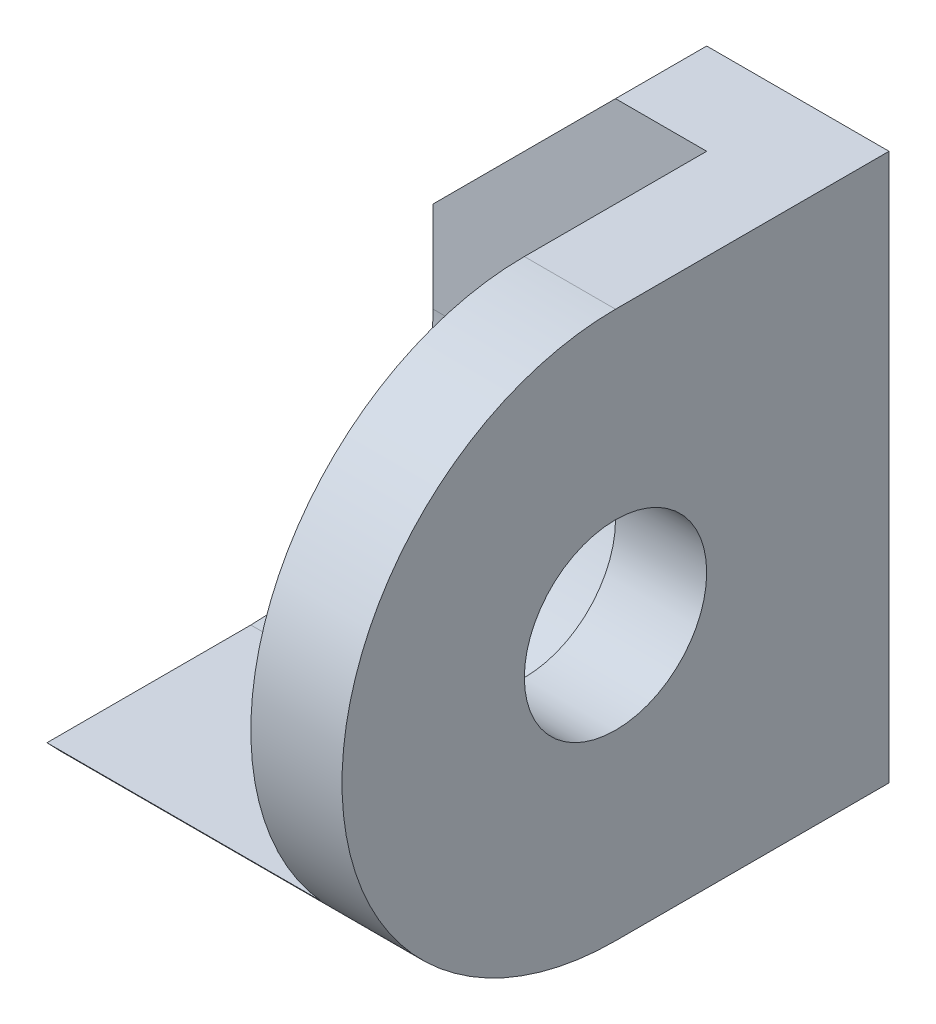
ISO-10303-21;
HEADER;
FILE_DESCRIPTION(('STEP AP214'),'2;1');
FILE_NAME('part.step','',(''),(''),'','','');
FILE_SCHEMA(('AUTOMOTIVE_DESIGN { 1 0 10303 214 1 1 1 1 }'));
ENDSEC;
DATA;
#1=APPLICATION_CONTEXT('core data for automotive mechanical design processes');
#2=APPLICATION_PROTOCOL_DEFINITION('international standard','automotive_design',2000,#1);
#3=PRODUCT_CONTEXT('',#1,'mechanical');
#4=PRODUCT('Part','Part','',(#3));
#5=PRODUCT_RELATED_PRODUCT_CATEGORY('part','',(#4));
#6=PRODUCT_DEFINITION_FORMATION('','',#4);
#7=PRODUCT_DEFINITION_CONTEXT('part definition',#1,'design');
#8=PRODUCT_DEFINITION('design','',#6,#7);
#9=PRODUCT_DEFINITION_SHAPE('','',#8);
#10=(LENGTH_UNIT() NAMED_UNIT(*) SI_UNIT(.MILLI.,.METRE.));
#11=(NAMED_UNIT(*) PLANE_ANGLE_UNIT() SI_UNIT($,.RADIAN.));
#12=(NAMED_UNIT(*) SI_UNIT($,.STERADIAN.) SOLID_ANGLE_UNIT());
#13=UNCERTAINTY_MEASURE_WITH_UNIT(LENGTH_MEASURE(1.E-05),#10,'distance_accuracy_value','');
#14=(GEOMETRIC_REPRESENTATION_CONTEXT(3) GLOBAL_UNCERTAINTY_ASSIGNED_CONTEXT((#13)) GLOBAL_UNIT_ASSIGNED_CONTEXT((#10,
#11,#12)) REPRESENTATION_CONTEXT('',''));
#15=CARTESIAN_POINT('',(0.,0.,0.));
#16=DIRECTION('',(0.,0.,1.));
#17=DIRECTION('',(1.,0.,0.));
#18=AXIS2_PLACEMENT_3D('',#15,#16,#17);
#19=CARTESIAN_POINT('',(-3.,0.,0.));
#20=DIRECTION('',(0.,-1.,0.));
#21=DIRECTION('',(0.,0.,-1.));
#22=AXIS2_PLACEMENT_3D('',#19,#20,#21);
#23=PLANE('',#22);
#24=DIRECTION('',(1.,0.,0.));
#25=VECTOR('',#24,1.);
#26=CARTESIAN_POINT('',(-3.,0.,0.));
#27=LINE('',#26,#25);
#28=CARTESIAN_POINT('',(-3.,0.,0.));
#29=VERTEX_POINT('',#28);
#30=CARTESIAN_POINT('',(1.,0.,0.));
#31=VERTEX_POINT('',#30);
#32=EDGE_CURVE('E171',#29,#31,#27,.T.);
#33=ORIENTED_EDGE('',*,*,#32,.T.);
#34=DIRECTION('',(0.,0.,-1.));
#35=VECTOR('',#34,1.);
#36=CARTESIAN_POINT('',(1.,0.,0.));
#37=LINE('',#36,#35);
#38=CARTESIAN_POINT('',(1.,0.,3.));
#39=VERTEX_POINT('',#38);
#40=EDGE_CURVE('E152',#39,#31,#37,.T.);
#41=ORIENTED_EDGE('',*,*,#40,.F.);
#42=DIRECTION('',(1.,0.,0.));
#43=VECTOR('',#42,1.);
#44=CARTESIAN_POINT('',(-3.,0.,3.));
#45=LINE('',#44,#43);
#46=CARTESIAN_POINT('',(-3.,0.,3.));
#47=VERTEX_POINT('',#46);
#48=EDGE_CURVE('E172',#47,#39,#45,.T.);
#49=ORIENTED_EDGE('',*,*,#48,.F.);
#50=DIRECTION('',(0.,0.,-1.));
#51=VECTOR('',#50,1.);
#52=CARTESIAN_POINT('',(-3.,0.,0.));
#53=LINE('',#52,#51);
#54=EDGE_CURVE('E164',#47,#29,#53,.T.);
#55=ORIENTED_EDGE('',*,*,#54,.T.);
#56=EDGE_LOOP('',(#33,#41,#49,#55));
#57=FACE_BOUND('',#56,.T.);
#58=ADVANCED_FACE('F37',(#57),#23,.T.);
#59=CARTESIAN_POINT('',(-3.,3.,3.));
#60=DIRECTION('',(1.,0.,0.));
#61=DIRECTION('',(0.,0.,-1.));
#62=AXIS2_PLACEMENT_3D('',#59,#60,#61);
#63=CYLINDRICAL_SURFACE('',#62,3.);
#64=DIRECTION('',(1.,0.,0.));
#65=VECTOR('',#64,1.);
#66=CARTESIAN_POINT('',(-3.,1.,5.23606797749979));
#67=LINE('',#66,#65);
#68=CARTESIAN_POINT('',(-3.,1.,5.23606797749979));
#69=VERTEX_POINT('',#68);
#70=CARTESIAN_POINT('',(0.,1.,5.23606797749979));
#71=VERTEX_POINT('',#70);
#72=EDGE_CURVE('E124',#69,#71,#67,.T.);
#73=ORIENTED_EDGE('',*,*,#72,.F.);
#74=CARTESIAN_POINT('',(-3.,3.,3.));
#75=DIRECTION('',(1.,0.,0.));
#76=DIRECTION('',(0.,0.,-1.));
#77=AXIS2_PLACEMENT_3D('',#74,#75,#76);
#78=CIRCLE('',#77,3.);
#79=EDGE_CURVE('E169',#69,#47,#78,.T.);
#80=ORIENTED_EDGE('',*,*,#79,.T.);
#81=ORIENTED_EDGE('',*,*,#48,.T.);
#82=CARTESIAN_POINT('',(1.,3.,3.));
#83=DIRECTION('',(1.,0.,0.));
#84=DIRECTION('',(0.,0.,-1.));
#85=AXIS2_PLACEMENT_3D('',#82,#83,#84);
#86=CIRCLE('',#85,3.);
#87=CARTESIAN_POINT('',(1.,6.,3.));
#88=VERTEX_POINT('',#87);
#89=EDGE_CURVE('E161',#88,#39,#86,.T.);
#90=ORIENTED_EDGE('',*,*,#89,.F.);
#91=DIRECTION('',(1.,0.,0.));
#92=VECTOR('',#91,1.);
#93=CARTESIAN_POINT('',(-3.,6.,3.));
#94=LINE('',#93,#92);
#95=CARTESIAN_POINT('',(0.,6.,3.));
#96=VERTEX_POINT('',#95);
#97=EDGE_CURVE('E175',#96,#88,#94,.T.);
#98=ORIENTED_EDGE('',*,*,#97,.F.);
#99=CARTESIAN_POINT('',(0.,3.,3.));
#100=DIRECTION('',(1.,0.,0.));
#101=DIRECTION('',(0.,0.,-1.));
#102=AXIS2_PLACEMENT_3D('',#99,#100,#101);
#103=CIRCLE('',#102,3.);
#104=EDGE_CURVE('E144',#71,#96,#103,.F.);
#105=ORIENTED_EDGE('',*,*,#104,.F.);
#106=EDGE_LOOP('',(#73,#80,#81,#90,#98,#105));
#107=FACE_BOUND('',#106,.T.);
#108=ADVANCED_FACE('F198',(#107),#63,.T.);
#109=CARTESIAN_POINT('',(-3.,6.,0.));
#110=DIRECTION('',(0.,1.,0.));
#111=DIRECTION('',(0.,0.,1.));
#112=AXIS2_PLACEMENT_3D('',#109,#110,#111);
#113=PLANE('',#112);
#114=DIRECTION('',(1.,0.,0.));
#115=VECTOR('',#114,1.);
#116=CARTESIAN_POINT('',(-3.,6.,0.));
#117=LINE('',#116,#115);
#118=CARTESIAN_POINT('',(-1.,6.,0.));
#119=VERTEX_POINT('',#118);
#120=CARTESIAN_POINT('',(1.,6.,0.));
#121=VERTEX_POINT('',#120);
#122=EDGE_CURVE('E177',#119,#121,#117,.T.);
#123=ORIENTED_EDGE('',*,*,#122,.F.);
#124=DIRECTION('',(0.,0.,1.));
#125=VECTOR('',#124,1.);
#126=CARTESIAN_POINT('',(-1.,6.,1.));
#127=LINE('',#126,#125);
#128=CARTESIAN_POINT('',(-1.,6.,1.));
#129=VERTEX_POINT('',#128);
#130=EDGE_CURVE('E174',#119,#129,#127,.T.);
#131=ORIENTED_EDGE('',*,*,#130,.T.);
#132=DIRECTION('',(-1.,0.,0.));
#133=VECTOR('',#132,1.);
#134=CARTESIAN_POINT('',(-3.,6.,1.));
#135=LINE('',#134,#133);
#136=CARTESIAN_POINT('',(0.,6.,1.));
#137=VERTEX_POINT('',#136);
#138=EDGE_CURVE('E147',#137,#129,#135,.T.);
#139=ORIENTED_EDGE('',*,*,#138,.F.);
#140=DIRECTION('',(0.,0.,-1.));
#141=VECTOR('',#140,1.);
#142=CARTESIAN_POINT('',(0.,6.,0.));
#143=LINE('',#142,#141);
#144=EDGE_CURVE('E142',#96,#137,#143,.T.);
#145=ORIENTED_EDGE('',*,*,#144,.F.);
#146=ORIENTED_EDGE('',*,*,#97,.T.);
#147=DIRECTION('',(0.,0.,1.));
#148=VECTOR('',#147,1.);
#149=CARTESIAN_POINT('',(1.,6.,0.));
#150=LINE('',#149,#148);
#151=EDGE_CURVE('E158',#121,#88,#150,.T.);
#152=ORIENTED_EDGE('',*,*,#151,.F.);
#153=EDGE_LOOP('',(#123,#131,#139,#145,#146,#152));
#154=FACE_BOUND('',#153,.T.);
#155=ADVANCED_FACE('F188',(#154),#113,.T.);
#156=CARTESIAN_POINT('',(-3.,0.,0.));
#157=DIRECTION('',(0.,0.,-1.));
#158=DIRECTION('',(-1.,0.,0.));
#159=AXIS2_PLACEMENT_3D('',#156,#157,#158);
#160=PLANE('',#159);
#161=DIRECTION('',(0.,1.,0.));
#162=VECTOR('',#161,1.);
#163=CARTESIAN_POINT('',(-3.,0.,0.));
#164=LINE('',#163,#162);
#165=CARTESIAN_POINT('',(-3.,4.,0.));
#166=VERTEX_POINT('',#165);
#167=EDGE_CURVE('E167',#29,#166,#164,.T.);
#168=ORIENTED_EDGE('',*,*,#167,.T.);
#169=DIRECTION('',(0.707106781186548,0.707106781186548,0.));
#170=VECTOR('',#169,1.);
#171=CARTESIAN_POINT('',(-5.,2.,0.));
#172=LINE('',#171,#170);
#173=EDGE_CURVE('E13',#166,#119,#172,.T.);
#174=ORIENTED_EDGE('',*,*,#173,.T.);
#175=ORIENTED_EDGE('',*,*,#122,.T.);
#176=DIRECTION('',(0.,1.,0.));
#177=VECTOR('',#176,1.);
#178=CARTESIAN_POINT('',(1.,0.,0.));
#179=LINE('',#178,#177);
#180=EDGE_CURVE('E155',#31,#121,#179,.T.);
#181=ORIENTED_EDGE('',*,*,#180,.F.);
#182=ORIENTED_EDGE('',*,*,#32,.F.);
#183=EDGE_LOOP('',(#168,#174,#175,#181,#182));
#184=FACE_BOUND('',#183,.T.);
#185=ADVANCED_FACE('F209',(#184),#160,.T.);
#186=CARTESIAN_POINT('',(-3.,3.,3.));
#187=DIRECTION('',(1.,0.,0.));
#188=DIRECTION('',(0.,0.,-1.));
#189=AXIS2_PLACEMENT_3D('',#186,#187,#188);
#190=PLANE('',#189);
#191=DIRECTION('',(0.,-1.,0.));
#192=VECTOR('',#191,1.);
#193=CARTESIAN_POINT('',(-3.,4.02041947789993,1.));
#194=LINE('',#193,#192);
#195=CARTESIAN_POINT('',(-3.,4.,1.));
#196=VERTEX_POINT('',#195);
#197=CARTESIAN_POINT('',(-3.,3.,1.));
#198=VERTEX_POINT('',#197);
#199=EDGE_CURVE('E132',#196,#198,#194,.T.);
#200=ORIENTED_EDGE('',*,*,#199,.F.);
#201=DIRECTION('',(0.,0.,-1.));
#202=VECTOR('',#201,1.);
#203=CARTESIAN_POINT('',(-3.,4.,0.));
#204=LINE('',#203,#202);
#205=EDGE_CURVE('E45',#196,#166,#204,.T.);
#206=ORIENTED_EDGE('',*,*,#205,.T.);
#207=ORIENTED_EDGE('',*,*,#167,.F.);
#208=ORIENTED_EDGE('',*,*,#54,.F.);
#209=ORIENTED_EDGE('',*,*,#79,.F.);
#210=DIRECTION('',(0.,0.,1.));
#211=VECTOR('',#210,1.);
#212=CARTESIAN_POINT('',(-3.,1.,3.));
#213=LINE('',#212,#211);
#214=CARTESIAN_POINT('',(-3.,1.,3.));
#215=VERTEX_POINT('',#214);
#216=EDGE_CURVE('E134',#215,#69,#213,.T.);
#217=ORIENTED_EDGE('',*,*,#216,.F.);
#218=CARTESIAN_POINT('',(-3.,3.,3.));
#219=DIRECTION('',(-1.,0.,0.));
#220=DIRECTION('',(0.,0.,-1.));
#221=AXIS2_PLACEMENT_3D('',#218,#219,#220);
#222=CIRCLE('',#221,2.);
#223=EDGE_CURVE('E114',#198,#215,#222,.T.);
#224=ORIENTED_EDGE('',*,*,#223,.F.);
#225=EDGE_LOOP('',(#200,#206,#207,#208,#209,#217,#224));
#226=FACE_BOUND('',#225,.T.);
#227=ADVANCED_FACE('F194',(#226),#190,.F.);
#228=CARTESIAN_POINT('',(-3.,3.,3.));
#229=DIRECTION('',(1.,0.,0.));
#230=DIRECTION('',(0.,0.,-1.));
#231=AXIS2_PLACEMENT_3D('',#228,#229,#230);
#232=CYLINDRICAL_SURFACE('',#231,1.);
#233=CARTESIAN_POINT('',(0.,3.,3.));
#234=DIRECTION('',(1.,0.,0.));
#235=DIRECTION('',(0.,0.,-1.));
#236=AXIS2_PLACEMENT_3D('',#233,#234,#235);
#237=CIRCLE('',#236,1.);
#238=CARTESIAN_POINT('',(0.,3.,2.));
#239=VERTEX_POINT('',#238);
#240=EDGE_CURVE('E140',#239,#239,#237,.F.);
#241=ORIENTED_EDGE('',*,*,#240,.T.);
#242=EDGE_LOOP('',(#241));
#243=FACE_BOUND('',#242,.T.);
#244=CARTESIAN_POINT('',(1.,3.,3.));
#245=DIRECTION('',(1.,0.,0.));
#246=DIRECTION('',(0.,0.,-1.));
#247=AXIS2_PLACEMENT_3D('',#244,#245,#246);
#248=CIRCLE('',#247,1.);
#249=CARTESIAN_POINT('',(1.,3.,2.));
#250=VERTEX_POINT('',#249);
#251=EDGE_CURVE('E149',#250,#250,#248,.T.);
#252=ORIENTED_EDGE('',*,*,#251,.T.);
#253=EDGE_LOOP('',(#252));
#254=FACE_BOUND('',#253,.T.);
#255=ADVANCED_FACE('F227',(#243,#254),#232,.F.);
#256=CARTESIAN_POINT('',(1.,3.,3.));
#257=DIRECTION('',(1.,0.,0.));
#258=DIRECTION('',(0.,0.,-1.));
#259=AXIS2_PLACEMENT_3D('',#256,#257,#258);
#260=PLANE('',#259);
#261=ORIENTED_EDGE('',*,*,#40,.T.);
#262=ORIENTED_EDGE('',*,*,#180,.T.);
#263=ORIENTED_EDGE('',*,*,#151,.T.);
#264=ORIENTED_EDGE('',*,*,#89,.T.);
#265=EDGE_LOOP('',(#261,#262,#263,#264));
#266=FACE_BOUND('',#265,.T.);
#267=ORIENTED_EDGE('',*,*,#251,.F.);
#268=EDGE_LOOP('',(#267));
#269=FACE_BOUND('',#268,.T.);
#270=ADVANCED_FACE('F203',(#266,#269),#260,.T.);
#271=CARTESIAN_POINT('',(0.,3.,3.));
#272=DIRECTION('',(1.,0.,0.));
#273=DIRECTION('',(0.,0.,-1.));
#274=AXIS2_PLACEMENT_3D('',#271,#272,#273);
#275=PLANE('',#274);
#276=ORIENTED_EDGE('',*,*,#104,.T.);
#277=ORIENTED_EDGE('',*,*,#144,.T.);
#278=DIRECTION('',(0.,-1.,0.));
#279=VECTOR('',#278,1.);
#280=CARTESIAN_POINT('',(0.,6.17419023362545,1.));
#281=LINE('',#280,#279);
#282=CARTESIAN_POINT('',(0.,3.,1.));
#283=VERTEX_POINT('',#282);
#284=EDGE_CURVE('E118',#137,#283,#281,.T.);
#285=ORIENTED_EDGE('',*,*,#284,.T.);
#286=CARTESIAN_POINT('',(0.,3.,3.));
#287=DIRECTION('',(-1.,0.,0.));
#288=DIRECTION('',(0.,0.,-1.));
#289=AXIS2_PLACEMENT_3D('',#286,#287,#288);
#290=CIRCLE('',#289,2.);
#291=CARTESIAN_POINT('',(0.,1.,3.));
#292=VERTEX_POINT('',#291);
#293=EDGE_CURVE('E112',#283,#292,#290,.T.);
#294=ORIENTED_EDGE('',*,*,#293,.T.);
#295=DIRECTION('',(0.,0.,1.));
#296=VECTOR('',#295,1.);
#297=CARTESIAN_POINT('',(0.,1.,3.));
#298=LINE('',#297,#296);
#299=EDGE_CURVE('E121',#292,#71,#298,.T.);
#300=ORIENTED_EDGE('',*,*,#299,.T.);
#301=EDGE_LOOP('',(#276,#277,#285,#294,#300));
#302=FACE_BOUND('',#301,.T.);
#303=ORIENTED_EDGE('',*,*,#240,.F.);
#304=EDGE_LOOP('',(#303));
#305=FACE_BOUND('',#304,.T.);
#306=ADVANCED_FACE('F128',(#302,#305),#275,.F.);
#307=CARTESIAN_POINT('',(0.,3.,3.));
#308=DIRECTION('',(-1.,0.,0.));
#309=DIRECTION('',(0.,0.,1.));
#310=AXIS2_PLACEMENT_3D('',#307,#308,#309);
#311=CYLINDRICAL_SURFACE('',#310,2.);
#312=ORIENTED_EDGE('',*,*,#223,.T.);
#313=DIRECTION('',(-1.,0.,0.));
#314=VECTOR('',#313,1.);
#315=CARTESIAN_POINT('',(0.,1.,3.));
#316=LINE('',#315,#314);
#317=EDGE_CURVE('E107',#292,#215,#316,.T.);
#318=ORIENTED_EDGE('',*,*,#317,.F.);
#319=ORIENTED_EDGE('',*,*,#293,.F.);
#320=DIRECTION('',(-1.,0.,0.));
#321=VECTOR('',#320,1.);
#322=CARTESIAN_POINT('',(0.,3.,1.));
#323=LINE('',#322,#321);
#324=EDGE_CURVE('E117',#283,#198,#323,.T.);
#325=ORIENTED_EDGE('',*,*,#324,.T.);
#326=EDGE_LOOP('',(#312,#318,#319,#325));
#327=FACE_BOUND('',#326,.T.);
#328=ADVANCED_FACE('F109',(#327),#311,.F.);
#329=CARTESIAN_POINT('',(0.,4.02041947789993,1.));
#330=DIRECTION('',(0.,0.,-1.));
#331=DIRECTION('',(-1.,0.,0.));
#332=AXIS2_PLACEMENT_3D('',#329,#330,#331);
#333=PLANE('',#332);
#334=ORIENTED_EDGE('',*,*,#138,.T.);
#335=DIRECTION('',(-0.707106781186548,-0.707106781186548,0.));
#336=VECTOR('',#335,1.);
#337=CARTESIAN_POINT('',(-1.,6.,1.));
#338=LINE('',#337,#336);
#339=EDGE_CURVE('E59',#129,#196,#338,.T.);
#340=ORIENTED_EDGE('',*,*,#339,.T.);
#341=ORIENTED_EDGE('',*,*,#199,.T.);
#342=ORIENTED_EDGE('',*,*,#324,.F.);
#343=ORIENTED_EDGE('',*,*,#284,.F.);
#344=EDGE_LOOP('',(#334,#340,#341,#342,#343));
#345=FACE_BOUND('',#344,.T.);
#346=ADVANCED_FACE('F193',(#345),#333,.F.);
#347=CARTESIAN_POINT('',(0.,1.,3.));
#348=DIRECTION('',(0.,-1.,0.));
#349=DIRECTION('',(0.,0.,-1.));
#350=AXIS2_PLACEMENT_3D('',#347,#348,#349);
#351=PLANE('',#350);
#352=ORIENTED_EDGE('',*,*,#72,.T.);
#353=ORIENTED_EDGE('',*,*,#299,.F.);
#354=ORIENTED_EDGE('',*,*,#317,.T.);
#355=ORIENTED_EDGE('',*,*,#216,.T.);
#356=EDGE_LOOP('',(#352,#353,#354,#355));
#357=FACE_BOUND('',#356,.T.);
#358=ADVANCED_FACE('F122',(#357),#351,.F.);
#359=CARTESIAN_POINT('',(-1.,6.,0.));
#360=DIRECTION('',(-0.707106781186548,0.707106781186548,0.));
#361=DIRECTION('',(0.,0.,-1.));
#362=AXIS2_PLACEMENT_3D('',#359,#360,#361);
#363=PLANE('',#362);
#364=ORIENTED_EDGE('',*,*,#173,.F.);
#365=ORIENTED_EDGE('',*,*,#205,.F.);
#366=ORIENTED_EDGE('',*,*,#339,.F.);
#367=ORIENTED_EDGE('',*,*,#130,.F.);
#368=EDGE_LOOP('',(#364,#365,#366,#367));
#369=FACE_BOUND('',#368,.T.);
#370=ADVANCED_FACE('F39',(#369),#363,.T.);
#371=CLOSED_SHELL('',(#58,#108,#155,#185,#227,#255,#270,#306,#328,#346,#358,#370));
#372=MANIFOLD_SOLID_BREP('B2',#371);
#373=ADVANCED_BREP_SHAPE_REPRESENTATION('',(#18,#372),#14);
#374=SHAPE_DEFINITION_REPRESENTATION(#9,#373);
ENDSEC;
END-ISO-10303-21;
